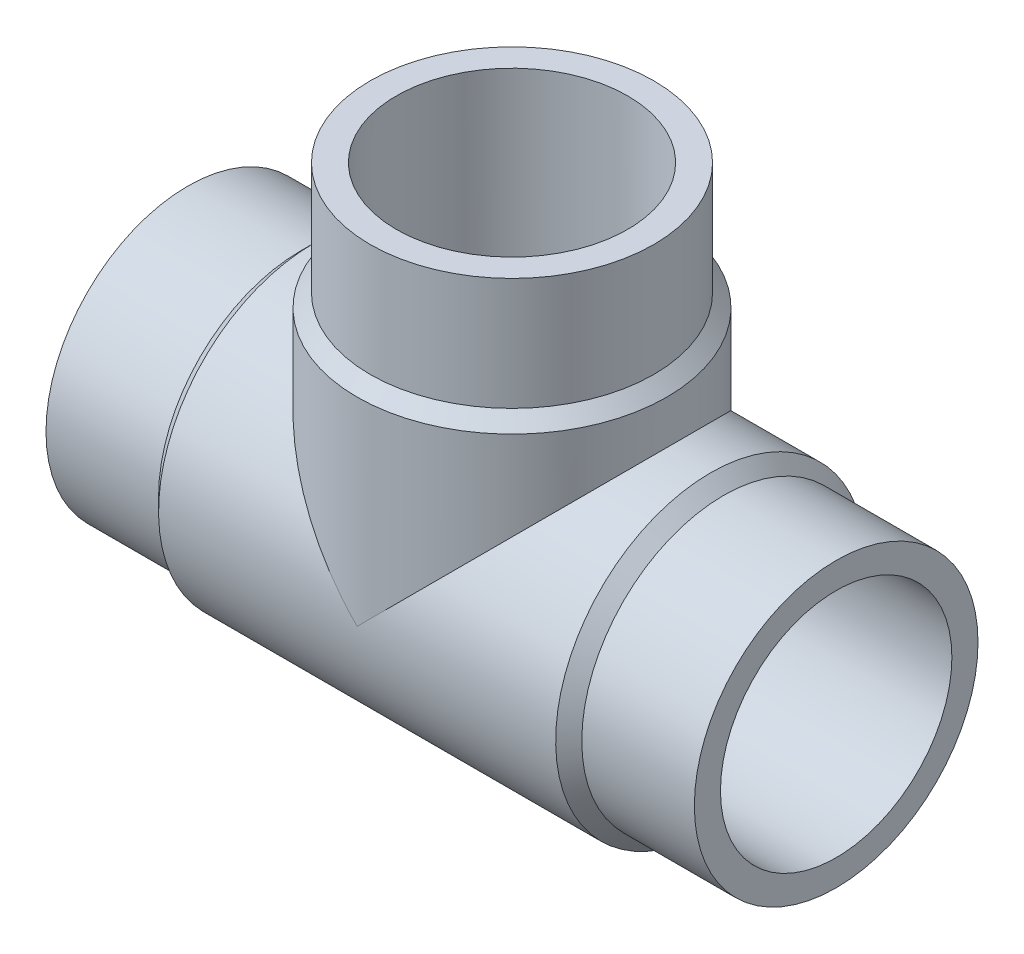
ISO-10303-21;
HEADER;
FILE_DESCRIPTION(('STEP AP214'),'2;1');
FILE_NAME('part.step','',(''),(''),'','','');
FILE_SCHEMA(('AUTOMOTIVE_DESIGN { 1 0 10303 214 1 1 1 1 }'));
ENDSEC;
DATA;
#1=APPLICATION_CONTEXT('core data for automotive mechanical design processes');
#2=APPLICATION_PROTOCOL_DEFINITION('international standard','automotive_design',2000,#1);
#3=PRODUCT_CONTEXT('',#1,'mechanical');
#4=PRODUCT('Part','Part','',(#3));
#5=PRODUCT_RELATED_PRODUCT_CATEGORY('part','',(#4));
#6=PRODUCT_DEFINITION_FORMATION('','',#4);
#7=PRODUCT_DEFINITION_CONTEXT('part definition',#1,'design');
#8=PRODUCT_DEFINITION('design','',#6,#7);
#9=PRODUCT_DEFINITION_SHAPE('','',#8);
#10=(LENGTH_UNIT() NAMED_UNIT(*) SI_UNIT(.MILLI.,.METRE.));
#11=(NAMED_UNIT(*) PLANE_ANGLE_UNIT() SI_UNIT($,.RADIAN.));
#12=(NAMED_UNIT(*) SI_UNIT($,.STERADIAN.) SOLID_ANGLE_UNIT());
#13=UNCERTAINTY_MEASURE_WITH_UNIT(LENGTH_MEASURE(1.E-05),#10,'distance_accuracy_value','');
#14=(GEOMETRIC_REPRESENTATION_CONTEXT(3) GLOBAL_UNCERTAINTY_ASSIGNED_CONTEXT((#13)) GLOBAL_UNIT_ASSIGNED_CONTEXT((#10,
#11,#12)) REPRESENTATION_CONTEXT('',''));
#15=CARTESIAN_POINT('',(0.,0.,0.));
#16=DIRECTION('',(0.,0.,1.));
#17=DIRECTION('',(1.,0.,0.));
#18=AXIS2_PLACEMENT_3D('',#15,#16,#17);
#19=CARTESIAN_POINT('',(-72.,72.,0.));
#20=DIRECTION('',(0.,1.,0.));
#21=DIRECTION('',(0.,0.,1.));
#22=AXIS2_PLACEMENT_3D('',#19,#20,#21);
#23=CYLINDRICAL_SURFACE('',#22,31.5);
#24=CARTESIAN_POINT('',(-72.,72.,0.));
#25=DIRECTION('',(0.,1.,0.));
#26=DIRECTION('',(0.,0.,1.));
#27=AXIS2_PLACEMENT_3D('',#24,#25,#26);
#28=CIRCLE('',#27,31.5);
#29=CARTESIAN_POINT('',(-72.,72.,31.5));
#30=VERTEX_POINT('',#29);
#31=EDGE_CURVE('E18',#30,#30,#28,.T.);
#32=ORIENTED_EDGE('',*,*,#31,.F.);
#33=EDGE_LOOP('',(#32));
#34=FACE_BOUND('',#33,.T.);
#35=CARTESIAN_POINT('',(-72.,47.,0.));
#36=DIRECTION('',(0.,1.,0.));
#37=DIRECTION('',(1.,0.,0.));
#38=AXIS2_PLACEMENT_3D('',#35,#36,#37);
#39=CIRCLE('',#38,31.5);
#40=CARTESIAN_POINT('',(-40.5,47.,0.));
#41=VERTEX_POINT('',#40);
#42=EDGE_CURVE('E71',#41,#41,#39,.F.);
#43=ORIENTED_EDGE('',*,*,#42,.F.);
#44=EDGE_LOOP('',(#43));
#45=FACE_BOUND('',#44,.T.);
#46=ADVANCED_FACE('F15',(#34,#45),#23,.T.);
#47=CARTESIAN_POINT('',(-72.,47.,0.));
#48=DIRECTION('',(0.,-1.,0.));
#49=DIRECTION('',(0.,0.,-1.));
#50=AXIS2_PLACEMENT_3D('',#47,#48,#49);
#51=CONICAL_SURFACE('',#50,31.5,0.785398163397453);
#52=CARTESIAN_POINT('',(-72.,44.1,0.));
#53=DIRECTION('',(0.,1.,0.));
#54=DIRECTION('',(1.,0.,0.));
#55=AXIS2_PLACEMENT_3D('',#52,#53,#54);
#56=CIRCLE('',#55,34.4);
#57=CARTESIAN_POINT('',(-37.6,44.1,0.));
#58=VERTEX_POINT('',#57);
#59=EDGE_CURVE('E60',#58,#58,#56,.F.);
#60=ORIENTED_EDGE('',*,*,#59,.F.);
#61=EDGE_LOOP('',(#60));
#62=FACE_BOUND('',#61,.T.);
#63=ORIENTED_EDGE('',*,*,#42,.T.);
#64=EDGE_LOOP('',(#63));
#65=FACE_BOUND('',#64,.T.);
#66=ADVANCED_FACE('F141',(#62,#65),#51,.T.);
#67=CARTESIAN_POINT('',(-25.,0.,0.));
#68=DIRECTION('',(-1.,0.,0.));
#69=DIRECTION('',(0.,0.,1.));
#70=AXIS2_PLACEMENT_3D('',#67,#68,#69);
#71=CYLINDRICAL_SURFACE('',#70,31.5);
#72=CARTESIAN_POINT('',(-25.,0.,0.));
#73=DIRECTION('',(1.,0.,0.));
#74=DIRECTION('',(0.,1.,0.));
#75=AXIS2_PLACEMENT_3D('',#72,#73,#74);
#76=CIRCLE('',#75,31.5);
#77=CARTESIAN_POINT('',(-25.,31.5,0.));
#78=VERTEX_POINT('',#77);
#79=EDGE_CURVE('E64',#78,#78,#76,.F.);
#80=ORIENTED_EDGE('',*,*,#79,.F.);
#81=EDGE_LOOP('',(#80));
#82=FACE_BOUND('',#81,.T.);
#83=CARTESIAN_POINT('',(0.,0.,0.));
#84=DIRECTION('',(-1.,0.,0.));
#85=DIRECTION('',(0.,0.,1.));
#86=AXIS2_PLACEMENT_3D('',#83,#84,#85);
#87=CIRCLE('',#86,31.5);
#88=CARTESIAN_POINT('',(0.,0.,31.5));
#89=VERTEX_POINT('',#88);
#90=EDGE_CURVE('E58',#89,#89,#87,.F.);
#91=ORIENTED_EDGE('',*,*,#90,.F.);
#92=EDGE_LOOP('',(#91));
#93=FACE_BOUND('',#92,.T.);
#94=ADVANCED_FACE('F136',(#82,#93),#71,.T.);
#95=CARTESIAN_POINT('',(-103.5,72.,31.878001054265));
#96=DIRECTION('',(0.,1.,0.));
#97=DIRECTION('',(1.,0.,0.));
#98=AXIS2_PLACEMENT_3D('',#95,#96,#97);
#99=PLANE('',#98);
#100=CARTESIAN_POINT('',(-72.,72.,0.));
#101=DIRECTION('',(0.,1.,0.));
#102=DIRECTION('',(0.,0.,1.));
#103=AXIS2_PLACEMENT_3D('',#100,#101,#102);
#104=CIRCLE('',#103,25.7);
#105=CARTESIAN_POINT('',(-72.,72.,25.7));
#106=VERTEX_POINT('',#105);
#107=EDGE_CURVE('E52',#106,#106,#104,.T.);
#108=ORIENTED_EDGE('',*,*,#107,.F.);
#109=EDGE_LOOP('',(#108));
#110=FACE_BOUND('',#109,.T.);
#111=ORIENTED_EDGE('',*,*,#31,.T.);
#112=EDGE_LOOP('',(#111));
#113=FACE_BOUND('',#112,.T.);
#114=ADVANCED_FACE('F130',(#110,#113),#99,.T.);
#115=CARTESIAN_POINT('',(-25.,0.,0.));
#116=DIRECTION('',(-1.,0.,0.));
#117=DIRECTION('',(0.,0.,1.));
#118=AXIS2_PLACEMENT_3D('',#115,#116,#117);
#119=CONICAL_SURFACE('',#118,31.5,0.785398163397451);
#120=ORIENTED_EDGE('',*,*,#79,.T.);
#121=EDGE_LOOP('',(#120));
#122=FACE_BOUND('',#121,.T.);
#123=CARTESIAN_POINT('',(-27.9,0.,0.));
#124=DIRECTION('',(-1.,0.,0.));
#125=DIRECTION('',(0.,1.,0.));
#126=AXIS2_PLACEMENT_3D('',#123,#124,#125);
#127=CIRCLE('',#126,34.4);
#128=CARTESIAN_POINT('',(-27.9,34.4,0.));
#129=VERTEX_POINT('',#128);
#130=EDGE_CURVE('E49',#129,#129,#127,.T.);
#131=ORIENTED_EDGE('',*,*,#130,.F.);
#132=EDGE_LOOP('',(#131));
#133=FACE_BOUND('',#132,.T.);
#134=ADVANCED_FACE('F95',(#122,#133),#119,.T.);
#135=CARTESIAN_POINT('',(-72.,44.1,0.));
#136=DIRECTION('',(0.,1.,0.));
#137=DIRECTION('',(0.,0.,1.));
#138=AXIS2_PLACEMENT_3D('',#135,#136,#137);
#139=CYLINDRICAL_SURFACE('',#138,34.4);
#140=CARTESIAN_POINT('',(-72.,0.,0.));
#141=DIRECTION('',(0.707106781186547,0.707106781186547,0.));
#142=DIRECTION('',(-0.707106781186547,0.707106781186547,0.));
#143=AXIS2_PLACEMENT_3D('',#140,#141,#142);
#144=ELLIPSE('',#143,48.6489465456345,34.4);
#145=CARTESIAN_POINT('',(-72.,0.,34.4));
#146=VERTEX_POINT('',#145);
#147=CARTESIAN_POINT('',(-72.,0.,-34.4));
#148=VERTEX_POINT('',#147);
#149=EDGE_CURVE('E44',#146,#148,#144,.F.);
#150=ORIENTED_EDGE('',*,*,#149,.F.);
#151=CARTESIAN_POINT('',(-72.,0.,0.));
#152=DIRECTION('',(-0.707106781186547,0.707106781186547,0.));
#153=DIRECTION('',(-0.707106781186547,-0.707106781186547,0.));
#154=AXIS2_PLACEMENT_3D('',#151,#152,#153);
#155=ELLIPSE('',#154,48.6489465456345,34.4);
#156=EDGE_CURVE('E40',#148,#146,#155,.F.);
#157=ORIENTED_EDGE('',*,*,#156,.F.);
#158=EDGE_LOOP('',(#150,#157));
#159=FACE_BOUND('',#158,.T.);
#160=ORIENTED_EDGE('',*,*,#59,.T.);
#161=EDGE_LOOP('',(#160));
#162=FACE_BOUND('',#161,.T.);
#163=ADVANCED_FACE('F47',(#159,#162),#139,.T.);
#164=CARTESIAN_POINT('',(0.,31.5,31.8780010540613));
#165=DIRECTION('',(1.,0.,0.));
#166=DIRECTION('',(0.,-1.,0.));
#167=AXIS2_PLACEMENT_3D('',#164,#165,#166);
#168=PLANE('',#167);
#169=CARTESIAN_POINT('',(0.,0.,0.));
#170=DIRECTION('',(-1.,0.,0.));
#171=DIRECTION('',(0.,0.,1.));
#172=AXIS2_PLACEMENT_3D('',#169,#170,#171);
#173=CIRCLE('',#172,25.7);
#174=CARTESIAN_POINT('',(0.,0.,25.7));
#175=VERTEX_POINT('',#174);
#176=EDGE_CURVE('E45',#175,#175,#173,.F.);
#177=ORIENTED_EDGE('',*,*,#176,.F.);
#178=EDGE_LOOP('',(#177));
#179=FACE_BOUND('',#178,.T.);
#180=ORIENTED_EDGE('',*,*,#90,.T.);
#181=EDGE_LOOP('',(#180));
#182=FACE_BOUND('',#181,.T.);
#183=ADVANCED_FACE('F85',(#179,#182),#168,.T.);
#184=CARTESIAN_POINT('',(-72.,0.,0.));
#185=DIRECTION('',(0.,1.,0.));
#186=DIRECTION('',(0.,0.,1.));
#187=AXIS2_PLACEMENT_3D('',#184,#185,#186);
#188=CYLINDRICAL_SURFACE('',#187,25.7);
#189=CARTESIAN_POINT('',(-72.,0.,0.));
#190=DIRECTION('',(-0.707106781186547,-0.707106781186547,0.));
#191=DIRECTION('',(-0.707106781186547,0.707106781186547,0.));
#192=AXIS2_PLACEMENT_3D('',#189,#190,#191);
#193=ELLIPSE('',#192,36.3452885529885,25.7);
#194=CARTESIAN_POINT('',(-72.,0.,-25.7));
#195=VERTEX_POINT('',#194);
#196=CARTESIAN_POINT('',(-72.,0.,25.7));
#197=VERTEX_POINT('',#196);
#198=EDGE_CURVE('E78',#195,#197,#193,.F.);
#199=ORIENTED_EDGE('',*,*,#198,.F.);
#200=CARTESIAN_POINT('',(-72.,0.,0.));
#201=DIRECTION('',(-0.707106781186547,0.707106781186547,0.));
#202=DIRECTION('',(0.707106781186547,0.707106781186547,0.));
#203=AXIS2_PLACEMENT_3D('',#200,#201,#202);
#204=ELLIPSE('',#203,36.3452885529885,25.7);
#205=EDGE_CURVE('E32',#195,#197,#204,.F.);
#206=ORIENTED_EDGE('',*,*,#205,.T.);
#207=EDGE_LOOP('',(#199,#206));
#208=FACE_BOUND('',#207,.T.);
#209=ORIENTED_EDGE('',*,*,#107,.T.);
#210=EDGE_LOOP('',(#209));
#211=FACE_BOUND('',#210,.T.);
#212=ADVANCED_FACE('F87',(#208,#211),#188,.F.);
#213=CARTESIAN_POINT('',(-116.1,0.,0.));
#214=DIRECTION('',(-1.,0.,0.));
#215=DIRECTION('',(0.,0.,1.));
#216=AXIS2_PLACEMENT_3D('',#213,#214,#215);
#217=CYLINDRICAL_SURFACE('',#216,34.4);
#218=ORIENTED_EDGE('',*,*,#130,.T.);
#219=EDGE_LOOP('',(#218));
#220=FACE_BOUND('',#219,.T.);
#221=CARTESIAN_POINT('',(-116.1,0.,0.));
#222=DIRECTION('',(-1.,0.,0.));
#223=DIRECTION('',(0.,1.,0.));
#224=AXIS2_PLACEMENT_3D('',#221,#222,#223);
#225=CIRCLE('',#224,34.4);
#226=CARTESIAN_POINT('',(-116.1,34.4,0.));
#227=VERTEX_POINT('',#226);
#228=EDGE_CURVE('E77',#227,#227,#225,.T.);
#229=ORIENTED_EDGE('',*,*,#228,.F.);
#230=EDGE_LOOP('',(#229));
#231=FACE_BOUND('',#230,.T.);
#232=ORIENTED_EDGE('',*,*,#149,.T.);
#233=ORIENTED_EDGE('',*,*,#156,.T.);
#234=EDGE_LOOP('',(#232,#233));
#235=FACE_BOUND('',#234,.T.);
#236=ADVANCED_FACE('F43',(#220,#231,#235),#217,.T.);
#237=CARTESIAN_POINT('',(-72.,0.,0.));
#238=DIRECTION('',(-1.,0.,0.));
#239=DIRECTION('',(0.,0.,1.));
#240=AXIS2_PLACEMENT_3D('',#237,#238,#239);
#241=CYLINDRICAL_SURFACE('',#240,25.7);
#242=ORIENTED_EDGE('',*,*,#205,.F.);
#243=ORIENTED_EDGE('',*,*,#198,.T.);
#244=EDGE_LOOP('',(#242,#243));
#245=FACE_BOUND('',#244,.T.);
#246=ORIENTED_EDGE('',*,*,#176,.T.);
#247=EDGE_LOOP('',(#246));
#248=FACE_BOUND('',#247,.T.);
#249=CARTESIAN_POINT('',(-144.,0.,0.));
#250=DIRECTION('',(-1.,0.,0.));
#251=DIRECTION('',(0.,0.,1.));
#252=AXIS2_PLACEMENT_3D('',#249,#250,#251);
#253=CIRCLE('',#252,25.7);
#254=CARTESIAN_POINT('',(-144.,0.,25.7));
#255=VERTEX_POINT('',#254);
#256=EDGE_CURVE('E74',#255,#255,#253,.F.);
#257=ORIENTED_EDGE('',*,*,#256,.F.);
#258=EDGE_LOOP('',(#257));
#259=FACE_BOUND('',#258,.T.);
#260=ADVANCED_FACE('F82',(#245,#248,#259),#241,.F.);
#261=CARTESIAN_POINT('',(-119.,0.,0.));
#262=DIRECTION('',(1.,0.,0.));
#263=DIRECTION('',(0.,0.,-1.));
#264=AXIS2_PLACEMENT_3D('',#261,#262,#263);
#265=CONICAL_SURFACE('',#264,31.5,0.785398163397455);
#266=ORIENTED_EDGE('',*,*,#228,.T.);
#267=EDGE_LOOP('',(#266));
#268=FACE_BOUND('',#267,.T.);
#269=CARTESIAN_POINT('',(-119.,0.,0.));
#270=DIRECTION('',(-1.,0.,0.));
#271=DIRECTION('',(0.,1.,0.));
#272=AXIS2_PLACEMENT_3D('',#269,#270,#271);
#273=CIRCLE('',#272,31.5);
#274=CARTESIAN_POINT('',(-119.,31.5,0.));
#275=VERTEX_POINT('',#274);
#276=EDGE_CURVE('E24',#275,#275,#273,.T.);
#277=ORIENTED_EDGE('',*,*,#276,.F.);
#278=EDGE_LOOP('',(#277));
#279=FACE_BOUND('',#278,.T.);
#280=ADVANCED_FACE('F105',(#268,#279),#265,.T.);
#281=CARTESIAN_POINT('',(-144.,-31.5,31.8780010542674));
#282=DIRECTION('',(-1.,0.,0.));
#283=DIRECTION('',(0.,1.,0.));
#284=AXIS2_PLACEMENT_3D('',#281,#282,#283);
#285=PLANE('',#284);
#286=ORIENTED_EDGE('',*,*,#256,.T.);
#287=EDGE_LOOP('',(#286));
#288=FACE_BOUND('',#287,.T.);
#289=CARTESIAN_POINT('',(-144.,0.,0.));
#290=DIRECTION('',(-1.,0.,0.));
#291=DIRECTION('',(0.,0.,1.));
#292=AXIS2_PLACEMENT_3D('',#289,#290,#291);
#293=CIRCLE('',#292,31.5);
#294=CARTESIAN_POINT('',(-144.,0.,31.5));
#295=VERTEX_POINT('',#294);
#296=EDGE_CURVE('E9',#295,#295,#293,.F.);
#297=ORIENTED_EDGE('',*,*,#296,.F.);
#298=EDGE_LOOP('',(#297));
#299=FACE_BOUND('',#298,.T.);
#300=ADVANCED_FACE('F99',(#288,#299),#285,.T.);
#301=CARTESIAN_POINT('',(-144.,0.,0.));
#302=DIRECTION('',(-1.,0.,0.));
#303=DIRECTION('',(0.,0.,1.));
#304=AXIS2_PLACEMENT_3D('',#301,#302,#303);
#305=CYLINDRICAL_SURFACE('',#304,31.5);
#306=ORIENTED_EDGE('',*,*,#276,.T.);
#307=EDGE_LOOP('',(#306));
#308=FACE_BOUND('',#307,.T.);
#309=ORIENTED_EDGE('',*,*,#296,.T.);
#310=EDGE_LOOP('',(#309));
#311=FACE_BOUND('',#310,.T.);
#312=ADVANCED_FACE('F97',(#308,#311),#305,.T.);
#313=CLOSED_SHELL('',(#46,#66,#94,#114,#134,#163,#183,#212,#236,#260,#280,#300,#312));
#314=MANIFOLD_SOLID_BREP('B1',#313);
#315=ADVANCED_BREP_SHAPE_REPRESENTATION('',(#18,#314),#14);
#316=SHAPE_DEFINITION_REPRESENTATION(#9,#315);
ENDSEC;
END-ISO-10303-21;
